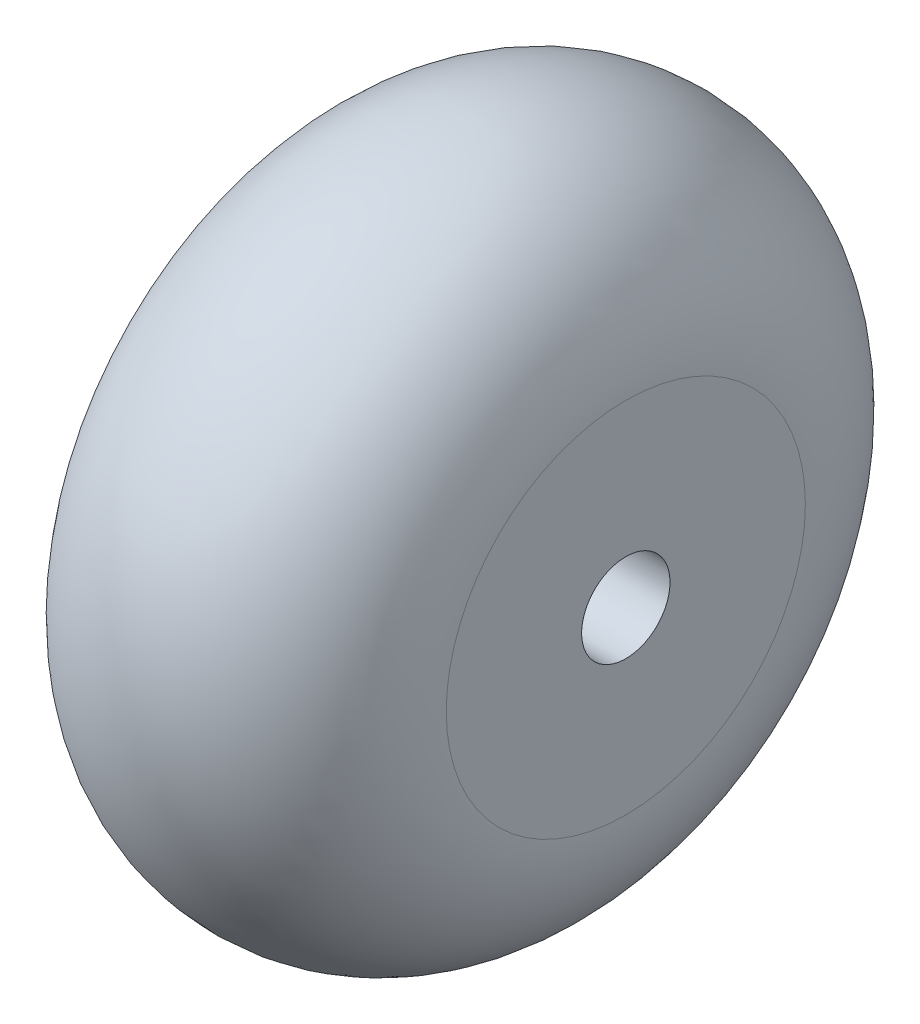
ISO-10303-21;
HEADER;
FILE_DESCRIPTION(('STEP AP214'),'2;1');
FILE_NAME('part.step','',(''),(''),'','','');
FILE_SCHEMA(('AUTOMOTIVE_DESIGN { 1 0 10303 214 1 1 1 1 }'));
ENDSEC;
DATA;
#1=APPLICATION_CONTEXT('core data for automotive mechanical design processes');
#2=APPLICATION_PROTOCOL_DEFINITION('international standard','automotive_design',2000,#1);
#3=PRODUCT_CONTEXT('',#1,'mechanical');
#4=PRODUCT('Part','Part','',(#3));
#5=PRODUCT_RELATED_PRODUCT_CATEGORY('part','',(#4));
#6=PRODUCT_DEFINITION_FORMATION('','',#4);
#7=PRODUCT_DEFINITION_CONTEXT('part definition',#1,'design');
#8=PRODUCT_DEFINITION('design','',#6,#7);
#9=PRODUCT_DEFINITION_SHAPE('','',#8);
#10=(LENGTH_UNIT() NAMED_UNIT(*) SI_UNIT(.MILLI.,.METRE.));
#11=(NAMED_UNIT(*) PLANE_ANGLE_UNIT() SI_UNIT($,.RADIAN.));
#12=(NAMED_UNIT(*) SI_UNIT($,.STERADIAN.) SOLID_ANGLE_UNIT());
#13=UNCERTAINTY_MEASURE_WITH_UNIT(LENGTH_MEASURE(1.E-05),#10,'distance_accuracy_value','');
#14=(GEOMETRIC_REPRESENTATION_CONTEXT(3) GLOBAL_UNCERTAINTY_ASSIGNED_CONTEXT((#13)) GLOBAL_UNIT_ASSIGNED_CONTEXT((#10,
#11,#12)) REPRESENTATION_CONTEXT('',''));
#15=CARTESIAN_POINT('',(0.,0.,0.));
#16=DIRECTION('',(0.,0.,1.));
#17=DIRECTION('',(1.,0.,0.));
#18=AXIS2_PLACEMENT_3D('',#15,#16,#17);
#19=CARTESIAN_POINT('',(6.00000000000001,6.50000000000001,0.));
#20=DIRECTION('',(-1.,0.,0.));
#21=DIRECTION('',(0.,0.,1.));
#22=AXIS2_PLACEMENT_3D('',#19,#20,#21);
#23=PLANE('',#22);
#24=CARTESIAN_POINT('',(6.00000000000001,0.,0.));
#25=DIRECTION('',(1.,0.,0.));
#26=DIRECTION('',(0.,0.,-1.));
#27=AXIS2_PLACEMENT_3D('',#24,#25,#26);
#28=CIRCLE('',#27,1.6);
#29=CARTESIAN_POINT('',(6.00000000000001,0.,-1.6));
#30=VERTEX_POINT('',#29);
#31=EDGE_CURVE('E58',#30,#30,#28,.T.);
#32=ORIENTED_EDGE('',*,*,#31,.F.);
#33=EDGE_LOOP('',(#32));
#34=FACE_BOUND('',#33,.T.);
#35=CARTESIAN_POINT('',(6.00000000000001,0.,0.));
#36=DIRECTION('',(-1.,0.,0.));
#37=DIRECTION('',(0.,0.,1.));
#38=AXIS2_PLACEMENT_3D('',#35,#36,#37);
#39=CIRCLE('',#38,6.50000000000001);
#40=CARTESIAN_POINT('',(6.00000000000001,0.,6.50000000000001));
#41=VERTEX_POINT('',#40);
#42=EDGE_CURVE('E10',#41,#41,#39,.T.);
#43=ORIENTED_EDGE('',*,*,#42,.F.);
#44=EDGE_LOOP('',(#43));
#45=FACE_BOUND('',#44,.T.);
#46=ADVANCED_FACE('F41',(#34,#45),#23,.F.);
#47=CARTESIAN_POINT('',(0.,0.,0.));
#48=DIRECTION('',(-1.,0.,0.));
#49=DIRECTION('',(0.,0.,1.));
#50=AXIS2_PLACEMENT_3D('',#47,#48,#49);
#51=TOROIDAL_SURFACE('',#50,6.50000000000001,6.00000000000001);
#52=CARTESIAN_POINT('',(-6.,0.,0.));
#53=DIRECTION('',(-1.,0.,0.));
#54=DIRECTION('',(0.,0.,1.));
#55=AXIS2_PLACEMENT_3D('',#52,#53,#54);
#56=CIRCLE('',#55,6.50000000000001);
#57=CARTESIAN_POINT('',(-6.,0.,6.50000000000001));
#58=VERTEX_POINT('',#57);
#59=EDGE_CURVE('E48',#58,#58,#56,.T.);
#60=ORIENTED_EDGE('',*,*,#59,.F.);
#61=EDGE_LOOP('',(#60));
#62=FACE_BOUND('',#61,.T.);
#63=ORIENTED_EDGE('',*,*,#42,.T.);
#64=EDGE_LOOP('',(#63));
#65=FACE_BOUND('',#64,.T.);
#66=ADVANCED_FACE('F69',(#62,#65),#51,.T.);
#67=CARTESIAN_POINT('',(-6.,6.50000000000001,0.));
#68=DIRECTION('',(1.,0.,0.));
#69=DIRECTION('',(0.,0.,-1.));
#70=AXIS2_PLACEMENT_3D('',#67,#68,#69);
#71=PLANE('',#70);
#72=CARTESIAN_POINT('',(-6.,0.,0.));
#73=DIRECTION('',(1.,0.,0.));
#74=DIRECTION('',(0.,0.,-1.));
#75=AXIS2_PLACEMENT_3D('',#72,#73,#74);
#76=CIRCLE('',#75,1.6);
#77=CARTESIAN_POINT('',(-6.,0.,-1.6));
#78=VERTEX_POINT('',#77);
#79=EDGE_CURVE('E53',#78,#78,#76,.T.);
#80=ORIENTED_EDGE('',*,*,#79,.T.);
#81=EDGE_LOOP('',(#80));
#82=FACE_BOUND('',#81,.T.);
#83=ORIENTED_EDGE('',*,*,#59,.T.);
#84=EDGE_LOOP('',(#83));
#85=FACE_BOUND('',#84,.T.);
#86=ADVANCED_FACE('F73',(#82,#85),#71,.F.);
#87=CARTESIAN_POINT('',(-6.,0.,0.));
#88=DIRECTION('',(1.,0.,0.));
#89=DIRECTION('',(0.,0.,-1.));
#90=AXIS2_PLACEMENT_3D('',#87,#88,#89);
#91=CYLINDRICAL_SURFACE('',#90,1.6);
#92=ORIENTED_EDGE('',*,*,#79,.F.);
#93=EDGE_LOOP('',(#92));
#94=FACE_BOUND('',#93,.T.);
#95=ORIENTED_EDGE('',*,*,#31,.T.);
#96=EDGE_LOOP('',(#95));
#97=FACE_BOUND('',#96,.T.);
#98=ADVANCED_FACE('F65',(#94,#97),#91,.F.);
#99=CLOSED_SHELL('',(#46,#66,#86,#98));
#100=MANIFOLD_SOLID_BREP('B2',#99);
#101=ADVANCED_BREP_SHAPE_REPRESENTATION('',(#18,#100),#14);
#102=SHAPE_DEFINITION_REPRESENTATION(#9,#101);
ENDSEC;
END-ISO-10303-21;
